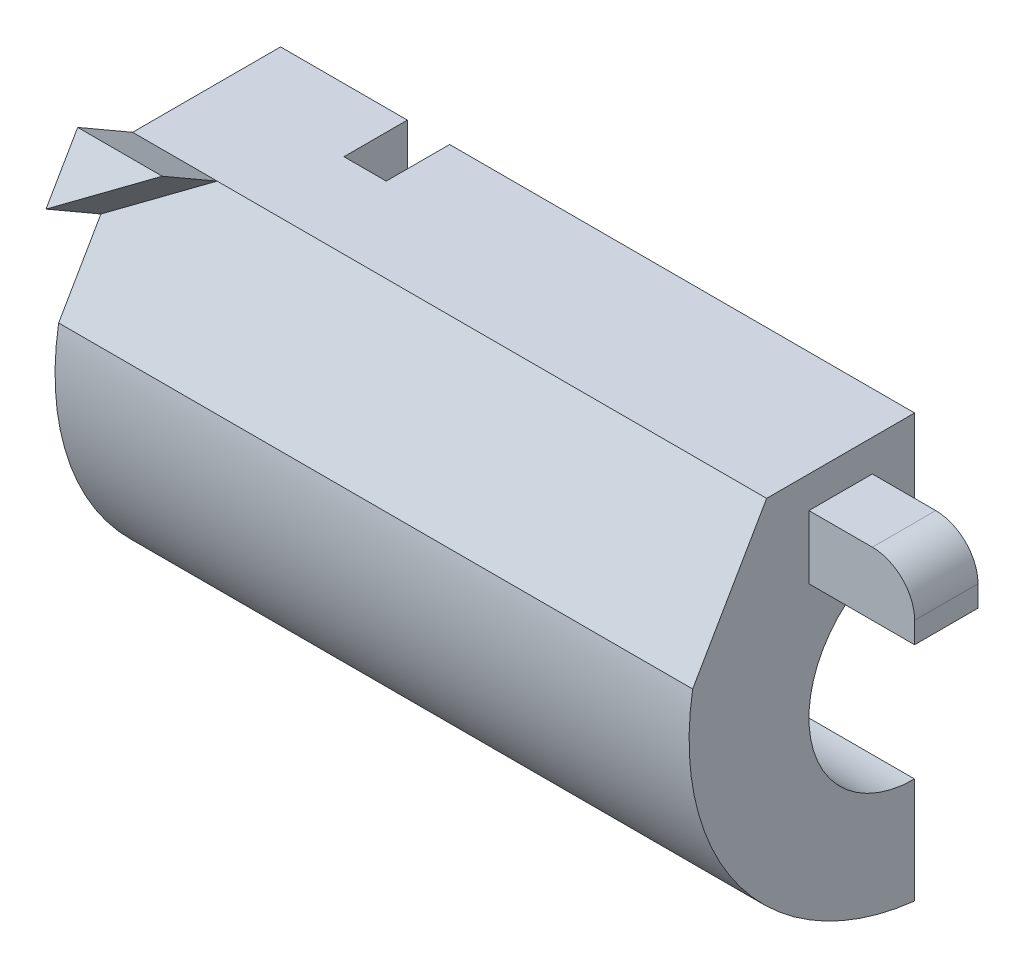
ISO-10303-21;
HEADER;
FILE_DESCRIPTION(('STEP AP214'),'2;1');
FILE_NAME('part.step','',(''),(''),'','','');
FILE_SCHEMA(('AUTOMOTIVE_DESIGN { 1 0 10303 214 1 1 1 1 }'));
ENDSEC;
DATA;
#1=APPLICATION_CONTEXT('core data for automotive mechanical design processes');
#2=APPLICATION_PROTOCOL_DEFINITION('international standard','automotive_design',2000,#1);
#3=PRODUCT_CONTEXT('',#1,'mechanical');
#4=PRODUCT('Part','Part','',(#3));
#5=PRODUCT_RELATED_PRODUCT_CATEGORY('part','',(#4));
#6=PRODUCT_DEFINITION_FORMATION('','',#4);
#7=PRODUCT_DEFINITION_CONTEXT('part definition',#1,'design');
#8=PRODUCT_DEFINITION('design','',#6,#7);
#9=PRODUCT_DEFINITION_SHAPE('','',#8);
#10=(LENGTH_UNIT() NAMED_UNIT(*) SI_UNIT(.MILLI.,.METRE.));
#11=(NAMED_UNIT(*) PLANE_ANGLE_UNIT() SI_UNIT($,.RADIAN.));
#12=(NAMED_UNIT(*) SI_UNIT($,.STERADIAN.) SOLID_ANGLE_UNIT());
#13=UNCERTAINTY_MEASURE_WITH_UNIT(LENGTH_MEASURE(1.E-05),#10,'distance_accuracy_value','');
#14=(GEOMETRIC_REPRESENTATION_CONTEXT(3) GLOBAL_UNCERTAINTY_ASSIGNED_CONTEXT((#13)) GLOBAL_UNIT_ASSIGNED_CONTEXT((#10,
#11,#12)) REPRESENTATION_CONTEXT('',''));
#15=CARTESIAN_POINT('',(0.,0.,0.));
#16=DIRECTION('',(0.,0.,1.));
#17=DIRECTION('',(1.,0.,0.));
#18=AXIS2_PLACEMENT_3D('',#15,#16,#17);
#19=CARTESIAN_POINT('',(-30.,-10.,0.));
#20=DIRECTION('',(0.,0.,-1.));
#21=DIRECTION('',(-1.,0.,0.));
#22=AXIS2_PLACEMENT_3D('',#19,#20,#21);
#23=PLANE('',#22);
#24=DIRECTION('',(0.,1.,0.));
#25=VECTOR('',#24,1.);
#26=CARTESIAN_POINT('',(-24.,1.5,0.));
#27=LINE('',#26,#25);
#28=CARTESIAN_POINT('',(-24.,3.,0.));
#29=VERTEX_POINT('',#28);
#30=CARTESIAN_POINT('',(-24.,10.,0.));
#31=VERTEX_POINT('',#30);
#32=EDGE_CURVE('E233',#29,#31,#27,.T.);
#33=ORIENTED_EDGE('',*,*,#32,.F.);
#34=DIRECTION('',(-1.,0.,0.));
#35=VECTOR('',#34,1.);
#36=CARTESIAN_POINT('',(-20.,3.,0.));
#37=LINE('',#36,#35);
#38=CARTESIAN_POINT('',(-30.,3.,0.));
#39=VERTEX_POINT('',#38);
#40=EDGE_CURVE('E292',#29,#39,#37,.T.);
#41=ORIENTED_EDGE('',*,*,#40,.T.);
#42=DIRECTION('',(0.,1.,0.));
#43=VECTOR('',#42,1.);
#44=CARTESIAN_POINT('',(-30.,-10.,0.));
#45=LINE('',#44,#43);
#46=CARTESIAN_POINT('',(-30.,10.,0.));
#47=VERTEX_POINT('',#46);
#48=EDGE_CURVE('E326',#39,#47,#45,.T.);
#49=ORIENTED_EDGE('',*,*,#48,.T.);
#50=DIRECTION('',(1.,0.,0.));
#51=VECTOR('',#50,1.);
#52=CARTESIAN_POINT('',(-30.,10.,0.));
#53=LINE('',#52,#51);
#54=EDGE_CURVE('E361',#47,#31,#53,.T.);
#55=ORIENTED_EDGE('',*,*,#54,.T.);
#56=EDGE_LOOP('',(#33,#41,#49,#55));
#57=FACE_BOUND('',#56,.T.);
#58=ADVANCED_FACE('F39',(#57),#23,.T.);
#59=CARTESIAN_POINT('',(0.,1.92604983455538,-1.33016365297715));
#60=DIRECTION('',(1.,0.,0.));
#61=DIRECTION('',(0.,0.,-1.));
#62=AXIS2_PLACEMENT_3D('',#59,#60,#61);
#63=PLANE('',#62);
#64=CARTESIAN_POINT('',(0.,0.,0.));
#65=DIRECTION('',(1.,0.,0.));
#66=DIRECTION('',(0.,0.,1.));
#67=AXIS2_PLACEMENT_3D('',#64,#65,#66);
#68=CIRCLE('',#67,5.);
#69=CARTESIAN_POINT('',(0.,5.,0.));
#70=VERTEX_POINT('',#69);
#71=CARTESIAN_POINT('',(0.,-5.,0.));
#72=VERTEX_POINT('',#71);
#73=EDGE_CURVE('E299',#70,#72,#68,.T.);
#74=ORIENTED_EDGE('',*,*,#73,.F.);
#75=DIRECTION('',(0.,1.,0.));
#76=VECTOR('',#75,1.);
#77=CARTESIAN_POINT('',(0.,-10.,0.));
#78=LINE('',#77,#76);
#79=CARTESIAN_POINT('',(0.,10.,0.));
#80=VERTEX_POINT('',#79);
#81=EDGE_CURVE('E341',#70,#80,#78,.T.);
#82=ORIENTED_EDGE('',*,*,#81,.T.);
#83=DIRECTION('',(0.,0.,1.));
#84=VECTOR('',#83,1.);
#85=CARTESIAN_POINT('',(0.,10.,0.));
#86=LINE('',#85,#84);
#87=CARTESIAN_POINT('',(0.,10.,7.));
#88=VERTEX_POINT('',#87);
#89=EDGE_CURVE('E346',#80,#88,#86,.T.);
#90=ORIENTED_EDGE('',*,*,#89,.T.);
#91=DIRECTION('',(0.,-0.86602540378444,0.499999999999998));
#92=VECTOR('',#91,1.);
#93=CARTESIAN_POINT('',(0.,10.,7.));
#94=LINE('',#93,#92);
#95=CARTESIAN_POINT('',(0.,3.93782217350892,10.5));
#96=VERTEX_POINT('',#95);
#97=EDGE_CURVE('E327',#88,#96,#94,.T.);
#98=ORIENTED_EDGE('',*,*,#97,.T.);
#99=CARTESIAN_POINT('',(0.,1.92604983455538,-1.33016365297715));
#100=DIRECTION('',(1.,0.,0.));
#101=DIRECTION('',(0.,0.,-1.));
#102=AXIS2_PLACEMENT_3D('',#99,#100,#101);
#103=CIRCLE('',#102,12.);
#104=CARTESIAN_POINT('',(0.,-10.,0.));
#105=VERTEX_POINT('',#104);
#106=EDGE_CURVE('E318',#96,#105,#103,.T.);
#107=ORIENTED_EDGE('',*,*,#106,.T.);
#108=EDGE_CURVE('E342',#105,#72,#78,.T.);
#109=ORIENTED_EDGE('',*,*,#108,.T.);
#110=EDGE_LOOP('',(#74,#82,#90,#98,#107,#109));
#111=FACE_BOUND('',#110,.T.);
#112=DIRECTION('',(0.,0.,-1.));
#113=VECTOR('',#112,1.);
#114=CARTESIAN_POINT('',(0.,5.5,5.));
#115=LINE('',#114,#113);
#116=CARTESIAN_POINT('',(0.,5.5,5.));
#117=VERTEX_POINT('',#116);
#118=CARTESIAN_POINT('',(0.,5.5,2.));
#119=VERTEX_POINT('',#118);
#120=EDGE_CURVE('E261',#117,#119,#115,.T.);
#121=ORIENTED_EDGE('',*,*,#120,.F.);
#122=DIRECTION('',(0.,-1.,0.));
#123=VECTOR('',#122,1.);
#124=CARTESIAN_POINT('',(0.,8.5,5.));
#125=LINE('',#124,#123);
#126=CARTESIAN_POINT('',(0.,8.5,5.));
#127=VERTEX_POINT('',#126);
#128=EDGE_CURVE('E236',#127,#117,#125,.T.);
#129=ORIENTED_EDGE('',*,*,#128,.F.);
#130=DIRECTION('',(0.,0.,1.));
#131=VECTOR('',#130,1.);
#132=CARTESIAN_POINT('',(0.,8.5,5.));
#133=LINE('',#132,#131);
#134=CARTESIAN_POINT('',(0.,8.5,2.));
#135=VERTEX_POINT('',#134);
#136=EDGE_CURVE('E250',#135,#127,#133,.T.);
#137=ORIENTED_EDGE('',*,*,#136,.F.);
#138=DIRECTION('',(0.,1.,0.));
#139=VECTOR('',#138,1.);
#140=CARTESIAN_POINT('',(0.,8.5,2.));
#141=LINE('',#140,#139);
#142=EDGE_CURVE('E264',#119,#135,#141,.T.);
#143=ORIENTED_EDGE('',*,*,#142,.F.);
#144=EDGE_LOOP('',(#121,#129,#137,#143));
#145=FACE_BOUND('',#144,.T.);
#146=ADVANCED_FACE('F408',(#111,#145),#63,.T.);
#147=CARTESIAN_POINT('',(-30.,1.92604983455538,-1.33016365297715));
#148=DIRECTION('',(1.,0.,0.));
#149=DIRECTION('',(0.,0.,-1.));
#150=AXIS2_PLACEMENT_3D('',#147,#148,#149);
#151=CYLINDRICAL_SURFACE('',#150,12.);
#152=ORIENTED_EDGE('',*,*,#106,.F.);
#153=DIRECTION('',(1.,0.,0.));
#154=VECTOR('',#153,1.);
#155=CARTESIAN_POINT('',(-30.,3.93782217350892,10.5));
#156=LINE('',#155,#154);
#157=CARTESIAN_POINT('',(-30.,3.93782217350892,10.5));
#158=VERTEX_POINT('',#157);
#159=EDGE_CURVE('E353',#158,#96,#156,.T.);
#160=ORIENTED_EDGE('',*,*,#159,.F.);
#161=CARTESIAN_POINT('',(-30.,1.92604983455538,-1.33016365297715));
#162=DIRECTION('',(1.,0.,0.));
#163=DIRECTION('',(0.,0.,-1.));
#164=AXIS2_PLACEMENT_3D('',#161,#162,#163);
#165=CIRCLE('',#164,12.);
#166=CARTESIAN_POINT('',(-30.,-10.,0.));
#167=VERTEX_POINT('',#166);
#168=EDGE_CURVE('E322',#158,#167,#165,.T.);
#169=ORIENTED_EDGE('',*,*,#168,.T.);
#170=DIRECTION('',(1.,0.,0.));
#171=VECTOR('',#170,1.);
#172=CARTESIAN_POINT('',(-30.,-10.,0.));
#173=LINE('',#172,#171);
#174=EDGE_CURVE('E337',#167,#105,#173,.T.);
#175=ORIENTED_EDGE('',*,*,#174,.T.);
#176=EDGE_LOOP('',(#152,#160,#169,#175));
#177=FACE_BOUND('',#176,.T.);
#178=ADVANCED_FACE('F402',(#177),#151,.T.);
#179=CARTESIAN_POINT('',(-30.,10.,7.));
#180=DIRECTION('',(0.,0.499999999999998,0.86602540378444));
#181=DIRECTION('',(0.,-0.86602540378444,0.499999999999998));
#182=AXIS2_PLACEMENT_3D('',#179,#180,#181);
#183=PLANE('',#182);
#184=DIRECTION('',(0.8,0.519615242270664,-0.299999999999999));
#185=VECTOR('',#184,1.);
#186=CARTESIAN_POINT('',(-30.,7.40192378864668,8.49999999999999));
#187=LINE('',#186,#185);
#188=CARTESIAN_POINT('',(-30.,7.40192378864668,8.49999999999999));
#189=VERTEX_POINT('',#188);
#190=CARTESIAN_POINT('',(-26.,10.,7.));
#191=VERTEX_POINT('',#190);
#192=EDGE_CURVE('E55',#189,#191,#187,.T.);
#193=ORIENTED_EDGE('',*,*,#192,.F.);
#194=DIRECTION('',(0.,-0.86602540378444,0.499999999999998));
#195=VECTOR('',#194,1.);
#196=CARTESIAN_POINT('',(-30.,10.,7.));
#197=LINE('',#196,#195);
#198=EDGE_CURVE('E205',#189,#158,#197,.T.);
#199=ORIENTED_EDGE('',*,*,#198,.T.);
#200=ORIENTED_EDGE('',*,*,#159,.T.);
#201=ORIENTED_EDGE('',*,*,#97,.F.);
#202=DIRECTION('',(1.,0.,0.));
#203=VECTOR('',#202,1.);
#204=CARTESIAN_POINT('',(-30.,10.,7.));
#205=LINE('',#204,#203);
#206=EDGE_CURVE('E360',#191,#88,#205,.T.);
#207=ORIENTED_EDGE('',*,*,#206,.F.);
#208=EDGE_LOOP('',(#193,#199,#200,#201,#207));
#209=FACE_BOUND('',#208,.T.);
#210=ADVANCED_FACE('F405',(#209),#183,.T.);
#211=CARTESIAN_POINT('',(-30.,10.,0.));
#212=DIRECTION('',(0.,1.,0.));
#213=DIRECTION('',(0.,0.,1.));
#214=AXIS2_PLACEMENT_3D('',#211,#212,#213);
#215=PLANE('',#214);
#216=DIRECTION('',(0.,0.,1.));
#217=VECTOR('',#216,1.);
#218=CARTESIAN_POINT('',(-24.,10.,0.));
#219=LINE('',#218,#217);
#220=CARTESIAN_POINT('',(-24.,10.,3.));
#221=VERTEX_POINT('',#220);
#222=EDGE_CURVE('E207',#31,#221,#219,.T.);
#223=ORIENTED_EDGE('',*,*,#222,.F.);
#224=ORIENTED_EDGE('',*,*,#54,.F.);
#225=DIRECTION('',(0.,0.,1.));
#226=VECTOR('',#225,1.);
#227=CARTESIAN_POINT('',(-30.,10.,0.));
#228=LINE('',#227,#226);
#229=CARTESIAN_POINT('',(-30.,10.,7.));
#230=VERTEX_POINT('',#229);
#231=EDGE_CURVE('E332',#47,#230,#228,.T.);
#232=ORIENTED_EDGE('',*,*,#231,.T.);
#233=EDGE_CURVE('E357',#230,#191,#205,.T.);
#234=ORIENTED_EDGE('',*,*,#233,.T.);
#235=ORIENTED_EDGE('',*,*,#206,.T.);
#236=ORIENTED_EDGE('',*,*,#89,.F.);
#237=CARTESIAN_POINT('',(-22.,10.,0.));
#238=VERTEX_POINT('',#237);
#239=EDGE_CURVE('E365',#238,#80,#53,.T.);
#240=ORIENTED_EDGE('',*,*,#239,.F.);
#241=DIRECTION('',(0.,0.,-1.));
#242=VECTOR('',#241,1.);
#243=CARTESIAN_POINT('',(-22.,10.,0.));
#244=LINE('',#243,#242);
#245=CARTESIAN_POINT('',(-22.,10.,3.));
#246=VERTEX_POINT('',#245);
#247=EDGE_CURVE('E222',#246,#238,#244,.T.);
#248=ORIENTED_EDGE('',*,*,#247,.F.);
#249=DIRECTION('',(1.,0.,0.));
#250=VECTOR('',#249,1.);
#251=CARTESIAN_POINT('',(-24.,10.,3.));
#252=LINE('',#251,#250);
#253=EDGE_CURVE('E212',#221,#246,#252,.T.);
#254=ORIENTED_EDGE('',*,*,#253,.F.);
#255=EDGE_LOOP('',(#223,#224,#232,#234,#235,#236,#240,#248,#254));
#256=FACE_BOUND('',#255,.T.);
#257=ADVANCED_FACE('F415',(#256),#215,.T.);
#258=DIRECTION('',(0.,1.,0.));
#259=VECTOR('',#258,1.);
#260=CARTESIAN_POINT('',(-22.,1.5,0.));
#261=LINE('',#260,#259);
#262=CARTESIAN_POINT('',(-22.,3.,0.));
#263=VERTEX_POINT('',#262);
#264=EDGE_CURVE('E237',#263,#238,#261,.T.);
#265=ORIENTED_EDGE('',*,*,#264,.T.);
#266=ORIENTED_EDGE('',*,*,#239,.T.);
#267=ORIENTED_EDGE('',*,*,#81,.F.);
#268=DIRECTION('',(1.,0.,0.));
#269=VECTOR('',#268,1.);
#270=CARTESIAN_POINT('',(-10.,5.,0.));
#271=LINE('',#270,#269);
#272=CARTESIAN_POINT('',(-10.,5.,0.));
#273=VERTEX_POINT('',#272);
#274=EDGE_CURVE('E315',#273,#70,#271,.T.);
#275=ORIENTED_EDGE('',*,*,#274,.F.);
#276=DIRECTION('',(0.,1.,0.));
#277=VECTOR('',#276,1.);
#278=CARTESIAN_POINT('',(-10.,-5.,0.));
#279=LINE('',#278,#277);
#280=CARTESIAN_POINT('',(-10.,-5.,0.));
#281=VERTEX_POINT('',#280);
#282=EDGE_CURVE('E308',#281,#273,#279,.T.);
#283=ORIENTED_EDGE('',*,*,#282,.F.);
#284=DIRECTION('',(1.,0.,0.));
#285=VECTOR('',#284,1.);
#286=CARTESIAN_POINT('',(-10.,-5.,0.));
#287=LINE('',#286,#285);
#288=EDGE_CURVE('E312',#281,#72,#287,.T.);
#289=ORIENTED_EDGE('',*,*,#288,.T.);
#290=ORIENTED_EDGE('',*,*,#108,.F.);
#291=ORIENTED_EDGE('',*,*,#174,.F.);
#292=CARTESIAN_POINT('',(-30.,-3.,0.));
#293=VERTEX_POINT('',#292);
#294=EDGE_CURVE('E328',#167,#293,#45,.T.);
#295=ORIENTED_EDGE('',*,*,#294,.T.);
#296=DIRECTION('',(-1.,0.,0.));
#297=VECTOR('',#296,1.);
#298=CARTESIAN_POINT('',(-20.,-3.,0.));
#299=LINE('',#298,#297);
#300=CARTESIAN_POINT('',(-20.,-3.,0.));
#301=VERTEX_POINT('',#300);
#302=EDGE_CURVE('E296',#301,#293,#299,.T.);
#303=ORIENTED_EDGE('',*,*,#302,.F.);
#304=DIRECTION('',(0.,-1.,0.));
#305=VECTOR('',#304,1.);
#306=CARTESIAN_POINT('',(-20.,-3.,0.));
#307=LINE('',#306,#305);
#308=CARTESIAN_POINT('',(-20.,3.,0.));
#309=VERTEX_POINT('',#308);
#310=EDGE_CURVE('E288',#309,#301,#307,.T.);
#311=ORIENTED_EDGE('',*,*,#310,.F.);
#312=EDGE_CURVE('E300',#309,#263,#37,.T.);
#313=ORIENTED_EDGE('',*,*,#312,.T.);
#314=EDGE_LOOP('',(#265,#266,#267,#275,#283,#289,#290,#291,#295,#303,#311,#313));
#315=FACE_BOUND('',#314,.T.);
#316=ADVANCED_FACE('F391',(#315),#23,.T.);
#317=CARTESIAN_POINT('',(-30.,1.92604983455538,-1.33016365297715));
#318=DIRECTION('',(1.,0.,0.));
#319=DIRECTION('',(0.,0.,-1.));
#320=AXIS2_PLACEMENT_3D('',#317,#318,#319);
#321=PLANE('',#320);
#322=ORIENTED_EDGE('',*,*,#48,.F.);
#323=CARTESIAN_POINT('',(-30.,0.,0.));
#324=DIRECTION('',(-1.,0.,0.));
#325=DIRECTION('',(0.,0.,1.));
#326=AXIS2_PLACEMENT_3D('',#323,#324,#325);
#327=CIRCLE('',#326,3.);
#328=EDGE_CURVE('E283',#293,#39,#327,.T.);
#329=ORIENTED_EDGE('',*,*,#328,.F.);
#330=ORIENTED_EDGE('',*,*,#294,.F.);
#331=ORIENTED_EDGE('',*,*,#168,.F.);
#332=ORIENTED_EDGE('',*,*,#198,.F.);
#333=DIRECTION('',(0.,-0.499999999999998,-0.86602540378444));
#334=VECTOR('',#333,1.);
#335=CARTESIAN_POINT('',(-30.,8.90192378864668,11.0980762113533));
#336=LINE('',#335,#334);
#337=CARTESIAN_POINT('',(-30.,8.90192378864668,11.0980762113533));
#338=VERTEX_POINT('',#337);
#339=EDGE_CURVE('E186',#338,#189,#336,.T.);
#340=ORIENTED_EDGE('',*,*,#339,.F.);
#341=DIRECTION('',(0.,-0.86602540378444,0.499999999999998));
#342=VECTOR('',#341,1.);
#343=CARTESIAN_POINT('',(-30.,11.5,9.59807621135332));
#344=LINE('',#343,#342);
#345=CARTESIAN_POINT('',(-30.,11.5,9.59807621135332));
#346=VERTEX_POINT('',#345);
#347=EDGE_CURVE('E193',#346,#338,#344,.T.);
#348=ORIENTED_EDGE('',*,*,#347,.F.);
#349=DIRECTION('',(0.,-0.499999999999998,-0.86602540378444));
#350=VECTOR('',#349,1.);
#351=CARTESIAN_POINT('',(-30.,11.5,9.59807621135332));
#352=LINE('',#351,#350);
#353=EDGE_CURVE('E214',#346,#230,#352,.T.);
#354=ORIENTED_EDGE('',*,*,#353,.T.);
#355=ORIENTED_EDGE('',*,*,#231,.F.);
#356=EDGE_LOOP('',(#322,#329,#330,#331,#332,#340,#348,#354,#355));
#357=FACE_BOUND('',#356,.T.);
#358=ADVANCED_FACE('F203',(#357),#321,.F.);
#359=CARTESIAN_POINT('',(-10.,0.,0.));
#360=DIRECTION('',(1.,0.,0.));
#361=DIRECTION('',(0.,0.,-1.));
#362=AXIS2_PLACEMENT_3D('',#359,#360,#361);
#363=CYLINDRICAL_SURFACE('',#362,5.);
#364=ORIENTED_EDGE('',*,*,#73,.T.);
#365=ORIENTED_EDGE('',*,*,#288,.F.);
#366=CARTESIAN_POINT('',(-10.,0.,0.));
#367=DIRECTION('',(1.,0.,0.));
#368=DIRECTION('',(0.,0.,1.));
#369=AXIS2_PLACEMENT_3D('',#366,#367,#368);
#370=CIRCLE('',#369,5.);
#371=EDGE_CURVE('E304',#273,#281,#370,.T.);
#372=ORIENTED_EDGE('',*,*,#371,.F.);
#373=ORIENTED_EDGE('',*,*,#274,.T.);
#374=EDGE_LOOP('',(#364,#365,#372,#373));
#375=FACE_BOUND('',#374,.T.);
#376=ADVANCED_FACE('F457',(#375),#363,.F.);
#377=CARTESIAN_POINT('',(-10.,0.,0.));
#378=DIRECTION('',(-1.,0.,0.));
#379=DIRECTION('',(0.,0.,1.));
#380=AXIS2_PLACEMENT_3D('',#377,#378,#379);
#381=PLANE('',#380);
#382=ORIENTED_EDGE('',*,*,#371,.T.);
#383=ORIENTED_EDGE('',*,*,#282,.T.);
#384=EDGE_LOOP('',(#382,#383));
#385=FACE_BOUND('',#384,.T.);
#386=ADVANCED_FACE('F466',(#385),#381,.F.);
#387=CARTESIAN_POINT('',(-20.,0.,0.));
#388=DIRECTION('',(-1.,0.,0.));
#389=DIRECTION('',(0.,0.,1.));
#390=AXIS2_PLACEMENT_3D('',#387,#388,#389);
#391=CYLINDRICAL_SURFACE('',#390,3.);
#392=ORIENTED_EDGE('',*,*,#40,.F.);
#393=CARTESIAN_POINT('',(-24.,0.,0.));
#394=DIRECTION('',(-1.,0.,0.));
#395=DIRECTION('',(0.,0.,1.));
#396=AXIS2_PLACEMENT_3D('',#393,#394,#395);
#397=CIRCLE('',#396,3.);
#398=CARTESIAN_POINT('',(-24.,1.5,2.59807621135332));
#399=VERTEX_POINT('',#398);
#400=EDGE_CURVE('E11',#29,#399,#397,.F.);
#401=ORIENTED_EDGE('',*,*,#400,.T.);
#402=DIRECTION('',(-1.,0.,0.));
#403=VECTOR('',#402,1.);
#404=CARTESIAN_POINT('',(-20.,1.5,2.59807621135332));
#405=LINE('',#404,#403);
#406=CARTESIAN_POINT('',(-22.,1.5,2.59807621135332));
#407=VERTEX_POINT('',#406);
#408=EDGE_CURVE('E380',#407,#399,#405,.T.);
#409=ORIENTED_EDGE('',*,*,#408,.F.);
#410=CARTESIAN_POINT('',(-22.,0.,0.));
#411=DIRECTION('',(1.,0.,0.));
#412=DIRECTION('',(0.,0.,-1.));
#413=AXIS2_PLACEMENT_3D('',#410,#411,#412);
#414=CIRCLE('',#413,3.);
#415=EDGE_CURVE('E48',#407,#263,#414,.F.);
#416=ORIENTED_EDGE('',*,*,#415,.T.);
#417=ORIENTED_EDGE('',*,*,#312,.F.);
#418=CARTESIAN_POINT('',(-20.,0.,0.));
#419=DIRECTION('',(-1.,0.,0.));
#420=DIRECTION('',(0.,0.,1.));
#421=AXIS2_PLACEMENT_3D('',#418,#419,#420);
#422=CIRCLE('',#421,3.);
#423=EDGE_CURVE('E284',#301,#309,#422,.T.);
#424=ORIENTED_EDGE('',*,*,#423,.F.);
#425=ORIENTED_EDGE('',*,*,#302,.T.);
#426=ORIENTED_EDGE('',*,*,#328,.T.);
#427=EDGE_LOOP('',(#392,#401,#409,#416,#417,#424,#425,#426));
#428=FACE_BOUND('',#427,.T.);
#429=ADVANCED_FACE('F387',(#428),#391,.F.);
#430=CARTESIAN_POINT('',(-20.,0.,0.));
#431=DIRECTION('',(-1.,0.,0.));
#432=DIRECTION('',(0.,0.,1.));
#433=AXIS2_PLACEMENT_3D('',#430,#431,#432);
#434=PLANE('',#433);
#435=ORIENTED_EDGE('',*,*,#423,.T.);
#436=ORIENTED_EDGE('',*,*,#310,.T.);
#437=EDGE_LOOP('',(#435,#436));
#438=FACE_BOUND('',#437,.T.);
#439=ADVANCED_FACE('F395',(#438),#434,.T.);
#440=CARTESIAN_POINT('',(5.,8.5,5.));
#441=DIRECTION('',(0.,0.,-1.));
#442=DIRECTION('',(-1.,0.,0.));
#443=AXIS2_PLACEMENT_3D('',#440,#441,#442);
#444=PLANE('',#443);
#445=DIRECTION('',(0.,-1.,0.));
#446=VECTOR('',#445,1.);
#447=CARTESIAN_POINT('',(5.,8.5,5.));
#448=LINE('',#447,#446);
#449=CARTESIAN_POINT('',(5.,6.5,5.));
#450=VERTEX_POINT('',#449);
#451=CARTESIAN_POINT('',(5.,5.5,5.));
#452=VERTEX_POINT('',#451);
#453=EDGE_CURVE('E246',#450,#452,#448,.T.);
#454=ORIENTED_EDGE('',*,*,#453,.F.);
#455=CARTESIAN_POINT('',(3.,6.5,5.));
#456=DIRECTION('',(0.,0.,-1.));
#457=DIRECTION('',(-1.,0.,0.));
#458=AXIS2_PLACEMENT_3D('',#455,#456,#457);
#459=CIRCLE('',#458,2.);
#460=CARTESIAN_POINT('',(3.,8.5,5.));
#461=VERTEX_POINT('',#460);
#462=EDGE_CURVE('E371',#450,#461,#459,.F.);
#463=ORIENTED_EDGE('',*,*,#462,.T.);
#464=DIRECTION('',(-1.,0.,0.));
#465=VECTOR('',#464,1.);
#466=CARTESIAN_POINT('',(5.,8.5,5.));
#467=LINE('',#466,#465);
#468=EDGE_CURVE('E257',#461,#127,#467,.T.);
#469=ORIENTED_EDGE('',*,*,#468,.T.);
#470=ORIENTED_EDGE('',*,*,#128,.T.);
#471=DIRECTION('',(-1.,0.,0.));
#472=VECTOR('',#471,1.);
#473=CARTESIAN_POINT('',(5.,5.5,5.));
#474=LINE('',#473,#472);
#475=EDGE_CURVE('E280',#452,#117,#474,.T.);
#476=ORIENTED_EDGE('',*,*,#475,.F.);
#477=EDGE_LOOP('',(#454,#463,#469,#470,#476));
#478=FACE_BOUND('',#477,.T.);
#479=ADVANCED_FACE('F475',(#478),#444,.F.);
#480=CARTESIAN_POINT('',(5.,5.5,5.));
#481=DIRECTION('',(0.,1.,0.));
#482=DIRECTION('',(0.,0.,1.));
#483=AXIS2_PLACEMENT_3D('',#480,#481,#482);
#484=PLANE('',#483);
#485=ORIENTED_EDGE('',*,*,#120,.T.);
#486=DIRECTION('',(-1.,0.,0.));
#487=VECTOR('',#486,1.);
#488=CARTESIAN_POINT('',(5.,5.5,2.));
#489=LINE('',#488,#487);
#490=CARTESIAN_POINT('',(5.,5.5,2.));
#491=VERTEX_POINT('',#490);
#492=EDGE_CURVE('E276',#491,#119,#489,.T.);
#493=ORIENTED_EDGE('',*,*,#492,.F.);
#494=DIRECTION('',(0.,0.,-1.));
#495=VECTOR('',#494,1.);
#496=CARTESIAN_POINT('',(5.,5.5,5.));
#497=LINE('',#496,#495);
#498=EDGE_CURVE('E249',#452,#491,#497,.T.);
#499=ORIENTED_EDGE('',*,*,#498,.F.);
#500=ORIENTED_EDGE('',*,*,#475,.T.);
#501=EDGE_LOOP('',(#485,#493,#499,#500));
#502=FACE_BOUND('',#501,.T.);
#503=ADVANCED_FACE('F478',(#502),#484,.F.);
#504=CARTESIAN_POINT('',(5.,8.5,2.));
#505=DIRECTION('',(0.,0.,1.));
#506=DIRECTION('',(0.,-1.,0.));
#507=AXIS2_PLACEMENT_3D('',#504,#505,#506);
#508=PLANE('',#507);
#509=DIRECTION('',(-1.,0.,0.));
#510=VECTOR('',#509,1.);
#511=CARTESIAN_POINT('',(5.,8.5,2.));
#512=LINE('',#511,#510);
#513=CARTESIAN_POINT('',(3.,8.5,2.));
#514=VERTEX_POINT('',#513);
#515=EDGE_CURVE('E273',#514,#135,#512,.T.);
#516=ORIENTED_EDGE('',*,*,#515,.F.);
#517=CARTESIAN_POINT('',(3.,6.5,2.));
#518=DIRECTION('',(0.,0.,1.));
#519=DIRECTION('',(0.,-1.,0.));
#520=AXIS2_PLACEMENT_3D('',#517,#518,#519);
#521=CIRCLE('',#520,2.);
#522=CARTESIAN_POINT('',(5.,6.5,2.));
#523=VERTEX_POINT('',#522);
#524=EDGE_CURVE('E377',#514,#523,#521,.F.);
#525=ORIENTED_EDGE('',*,*,#524,.T.);
#526=DIRECTION('',(0.,1.,0.));
#527=VECTOR('',#526,1.);
#528=CARTESIAN_POINT('',(5.,8.5,2.));
#529=LINE('',#528,#527);
#530=EDGE_CURVE('E253',#491,#523,#529,.T.);
#531=ORIENTED_EDGE('',*,*,#530,.F.);
#532=ORIENTED_EDGE('',*,*,#492,.T.);
#533=ORIENTED_EDGE('',*,*,#142,.T.);
#534=EDGE_LOOP('',(#516,#525,#531,#532,#533));
#535=FACE_BOUND('',#534,.T.);
#536=ADVANCED_FACE('F482',(#535),#508,.F.);
#537=CARTESIAN_POINT('',(5.,8.5,5.));
#538=DIRECTION('',(0.,-1.,0.));
#539=DIRECTION('',(0.,0.,-1.));
#540=AXIS2_PLACEMENT_3D('',#537,#538,#539);
#541=PLANE('',#540);
#542=ORIENTED_EDGE('',*,*,#468,.F.);
#543=DIRECTION('',(0.,0.,1.));
#544=VECTOR('',#543,1.);
#545=CARTESIAN_POINT('',(3.,8.5,2.));
#546=LINE('',#545,#544);
#547=EDGE_CURVE('E374',#461,#514,#546,.F.);
#548=ORIENTED_EDGE('',*,*,#547,.T.);
#549=ORIENTED_EDGE('',*,*,#515,.T.);
#550=ORIENTED_EDGE('',*,*,#136,.T.);
#551=EDGE_LOOP('',(#542,#548,#549,#550));
#552=FACE_BOUND('',#551,.T.);
#553=ADVANCED_FACE('F486',(#552),#541,.F.);
#554=CARTESIAN_POINT('',(5.,0.,0.));
#555=DIRECTION('',(1.,0.,0.));
#556=DIRECTION('',(0.,0.,-1.));
#557=AXIS2_PLACEMENT_3D('',#554,#555,#556);
#558=PLANE('',#557);
#559=ORIENTED_EDGE('',*,*,#530,.T.);
#560=DIRECTION('',(0.,0.,1.));
#561=VECTOR('',#560,1.);
#562=CARTESIAN_POINT('',(5.,6.5,5.));
#563=LINE('',#562,#561);
#564=EDGE_CURVE('E356',#523,#450,#563,.T.);
#565=ORIENTED_EDGE('',*,*,#564,.T.);
#566=ORIENTED_EDGE('',*,*,#453,.T.);
#567=ORIENTED_EDGE('',*,*,#498,.T.);
#568=EDGE_LOOP('',(#559,#565,#566,#567));
#569=FACE_BOUND('',#568,.T.);
#570=ADVANCED_FACE('F490',(#569),#558,.T.);
#571=CARTESIAN_POINT('',(3.,6.5,0.));
#572=DIRECTION('',(0.,0.,-1.));
#573=DIRECTION('',(-1.,0.,0.));
#574=AXIS2_PLACEMENT_3D('',#571,#572,#573);
#575=CYLINDRICAL_SURFACE('',#574,2.);
#576=ORIENTED_EDGE('',*,*,#524,.F.);
#577=ORIENTED_EDGE('',*,*,#547,.F.);
#578=ORIENTED_EDGE('',*,*,#462,.F.);
#579=ORIENTED_EDGE('',*,*,#564,.F.);
#580=EDGE_LOOP('',(#576,#577,#578,#579));
#581=FACE_BOUND('',#580,.T.);
#582=ADVANCED_FACE('F41',(#581),#575,.T.);
#583=CARTESIAN_POINT('',(-24.,1.5,0.));
#584=DIRECTION('',(-1.,0.,0.));
#585=DIRECTION('',(0.,0.,1.));
#586=AXIS2_PLACEMENT_3D('',#583,#584,#585);
#587=PLANE('',#586);
#588=ORIENTED_EDGE('',*,*,#32,.T.);
#589=ORIENTED_EDGE('',*,*,#222,.T.);
#590=DIRECTION('',(0.,1.,0.));
#591=VECTOR('',#590,1.);
#592=CARTESIAN_POINT('',(-24.,1.5,3.));
#593=LINE('',#592,#591);
#594=CARTESIAN_POINT('',(-24.,1.5,3.));
#595=VERTEX_POINT('',#594);
#596=EDGE_CURVE('E226',#595,#221,#593,.T.);
#597=ORIENTED_EDGE('',*,*,#596,.F.);
#598=DIRECTION('',(0.,0.,1.));
#599=VECTOR('',#598,1.);
#600=CARTESIAN_POINT('',(-24.,1.5,0.));
#601=LINE('',#600,#599);
#602=EDGE_CURVE('E218',#399,#595,#601,.T.);
#603=ORIENTED_EDGE('',*,*,#602,.F.);
#604=ORIENTED_EDGE('',*,*,#400,.F.);
#605=EDGE_LOOP('',(#588,#589,#597,#603,#604));
#606=FACE_BOUND('',#605,.T.);
#607=ADVANCED_FACE('F428',(#606),#587,.F.);
#608=CARTESIAN_POINT('',(-22.,1.5,0.));
#609=DIRECTION('',(1.,0.,0.));
#610=DIRECTION('',(0.,0.,-1.));
#611=AXIS2_PLACEMENT_3D('',#608,#609,#610);
#612=PLANE('',#611);
#613=DIRECTION('',(0.,0.,-1.));
#614=VECTOR('',#613,1.);
#615=CARTESIAN_POINT('',(-22.,1.5,0.));
#616=LINE('',#615,#614);
#617=CARTESIAN_POINT('',(-22.,1.5,3.));
#618=VERTEX_POINT('',#617);
#619=EDGE_CURVE('E63',#618,#407,#616,.T.);
#620=ORIENTED_EDGE('',*,*,#619,.F.);
#621=DIRECTION('',(0.,1.,0.));
#622=VECTOR('',#621,1.);
#623=CARTESIAN_POINT('',(-22.,1.5,3.));
#624=LINE('',#623,#622);
#625=EDGE_CURVE('E241',#618,#246,#624,.T.);
#626=ORIENTED_EDGE('',*,*,#625,.T.);
#627=ORIENTED_EDGE('',*,*,#247,.T.);
#628=ORIENTED_EDGE('',*,*,#264,.F.);
#629=ORIENTED_EDGE('',*,*,#415,.F.);
#630=EDGE_LOOP('',(#620,#626,#627,#628,#629));
#631=FACE_BOUND('',#630,.T.);
#632=ADVANCED_FACE('F435',(#631),#612,.F.);
#633=CARTESIAN_POINT('',(0.,1.5,0.));
#634=DIRECTION('',(0.,1.,0.));
#635=DIRECTION('',(0.,0.,1.));
#636=AXIS2_PLACEMENT_3D('',#633,#634,#635);
#637=PLANE('',#636);
#638=ORIENTED_EDGE('',*,*,#408,.T.);
#639=ORIENTED_EDGE('',*,*,#602,.T.);
#640=DIRECTION('',(1.,0.,0.));
#641=VECTOR('',#640,1.);
#642=CARTESIAN_POINT('',(-24.,1.5,3.));
#643=LINE('',#642,#641);
#644=EDGE_CURVE('E221',#595,#618,#643,.T.);
#645=ORIENTED_EDGE('',*,*,#644,.T.);
#646=ORIENTED_EDGE('',*,*,#619,.T.);
#647=EDGE_LOOP('',(#638,#639,#645,#646));
#648=FACE_BOUND('',#647,.T.);
#649=ADVANCED_FACE('F431',(#648),#637,.T.);
#650=CARTESIAN_POINT('',(-24.,1.5,3.));
#651=DIRECTION('',(0.,0.,1.));
#652=DIRECTION('',(0.,-1.,0.));
#653=AXIS2_PLACEMENT_3D('',#650,#651,#652);
#654=PLANE('',#653);
#655=ORIENTED_EDGE('',*,*,#253,.T.);
#656=ORIENTED_EDGE('',*,*,#625,.F.);
#657=ORIENTED_EDGE('',*,*,#644,.F.);
#658=ORIENTED_EDGE('',*,*,#596,.T.);
#659=EDGE_LOOP('',(#655,#656,#657,#658));
#660=FACE_BOUND('',#659,.T.);
#661=ADVANCED_FACE('F433',(#660),#654,.F.);
#662=CARTESIAN_POINT('',(-30.,8.90192378864668,11.0980762113533));
#663=DIRECTION('',(-0.6,0.692820323027552,-0.399999999999998));
#664=DIRECTION('',(-0.755928946018455,-0.654653670707977,0.));
#665=AXIS2_PLACEMENT_3D('',#662,#663,#664);
#666=PLANE('',#665);
#667=ORIENTED_EDGE('',*,*,#192,.T.);
#668=DIRECTION('',(0.,-0.499999999999998,-0.86602540378444));
#669=VECTOR('',#668,1.);
#670=CARTESIAN_POINT('',(-26.,11.5,9.59807621135332));
#671=LINE('',#670,#669);
#672=CARTESIAN_POINT('',(-26.,11.5,9.59807621135332));
#673=VERTEX_POINT('',#672);
#674=EDGE_CURVE('E188',#673,#191,#671,.T.);
#675=ORIENTED_EDGE('',*,*,#674,.F.);
#676=DIRECTION('',(0.8,0.519615242270664,-0.299999999999999));
#677=VECTOR('',#676,1.);
#678=CARTESIAN_POINT('',(-30.,8.90192378864668,11.0980762113533));
#679=LINE('',#678,#677);
#680=EDGE_CURVE('E182',#338,#673,#679,.T.);
#681=ORIENTED_EDGE('',*,*,#680,.F.);
#682=ORIENTED_EDGE('',*,*,#339,.T.);
#683=EDGE_LOOP('',(#667,#675,#681,#682));
#684=FACE_BOUND('',#683,.T.);
#685=ADVANCED_FACE('F184',(#684),#666,.F.);
#686=CARTESIAN_POINT('',(-26.,11.5,9.59807621135332));
#687=DIRECTION('',(0.,-0.86602540378444,0.499999999999998));
#688=DIRECTION('',(0.,-0.499999999999998,-0.86602540378444));
#689=AXIS2_PLACEMENT_3D('',#686,#687,#688);
#690=PLANE('',#689);
#691=ORIENTED_EDGE('',*,*,#233,.F.);
#692=ORIENTED_EDGE('',*,*,#353,.F.);
#693=DIRECTION('',(-1.,0.,0.));
#694=VECTOR('',#693,1.);
#695=CARTESIAN_POINT('',(-26.,11.5,9.59807621135332));
#696=LINE('',#695,#694);
#697=EDGE_CURVE('E192',#673,#346,#696,.T.);
#698=ORIENTED_EDGE('',*,*,#697,.F.);
#699=ORIENTED_EDGE('',*,*,#674,.T.);
#700=EDGE_LOOP('',(#691,#692,#698,#699));
#701=FACE_BOUND('',#700,.T.);
#702=ADVANCED_FACE('F498',(#701),#690,.F.);
#703=CARTESIAN_POINT('',(0.,7.0310889132455,12.1782032302755));
#704=DIRECTION('',(0.,-0.499999999999998,-0.86602540378444));
#705=DIRECTION('',(0.,0.86602540378444,-0.499999999999998));
#706=AXIS2_PLACEMENT_3D('',#703,#704,#705);
#707=PLANE('',#706);
#708=ORIENTED_EDGE('',*,*,#347,.T.);
#709=ORIENTED_EDGE('',*,*,#680,.T.);
#710=ORIENTED_EDGE('',*,*,#697,.T.);
#711=EDGE_LOOP('',(#708,#709,#710));
#712=FACE_BOUND('',#711,.T.);
#713=ADVANCED_FACE('F196',(#712),#707,.F.);
#714=CLOSED_SHELL('',(#58,#146,#178,#210,#257,#316,#358,#376,#386,#429,#439,#479,#503,#536,#553,
#570,#582,#607,#632,#649,#661,#685,#702,#713));
#715=MANIFOLD_SOLID_BREP('B2',#714);
#716=ADVANCED_BREP_SHAPE_REPRESENTATION('',(#18,#715),#14);
#717=SHAPE_DEFINITION_REPRESENTATION(#9,#716);
ENDSEC;
END-ISO-10303-21;
